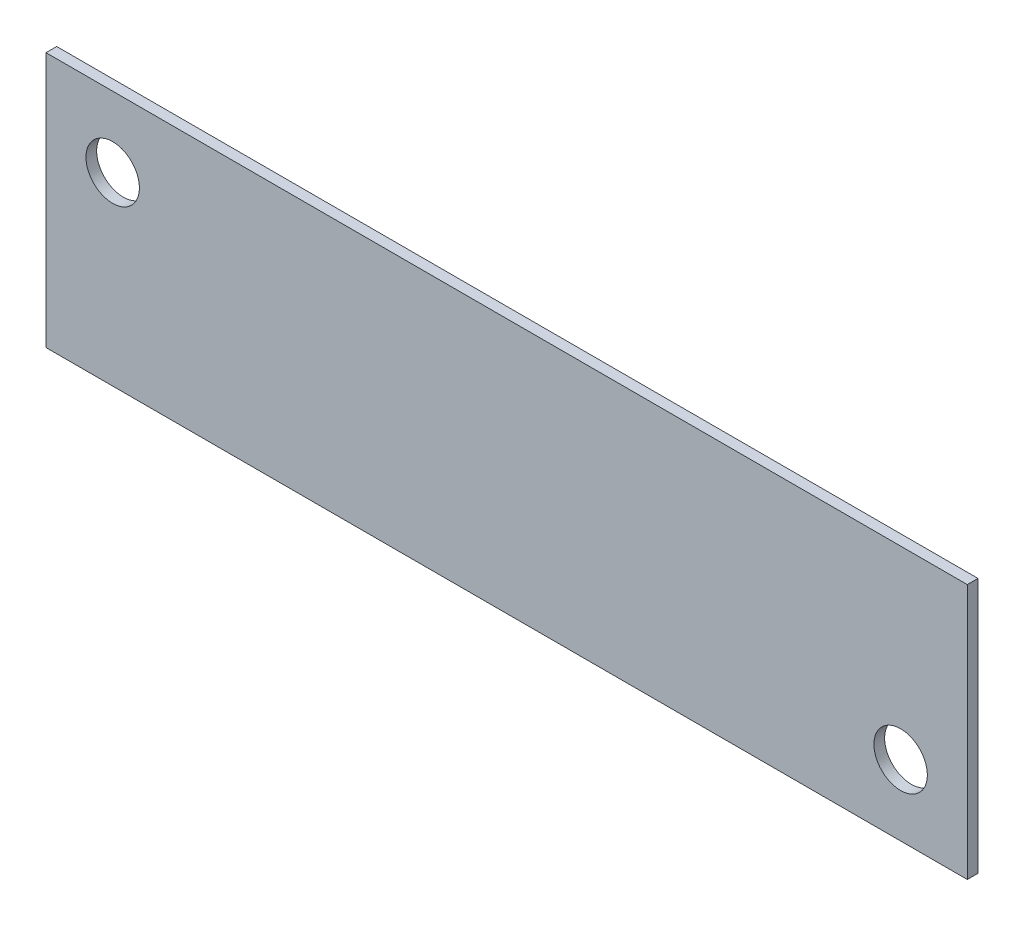
ISO-10303-21;
HEADER;
FILE_DESCRIPTION(('STEP AP214'),'2;1');
FILE_NAME('part.step','',(''),(''),'','','');
FILE_SCHEMA(('AUTOMOTIVE_DESIGN { 1 0 10303 214 1 1 1 1 }'));
ENDSEC;
DATA;
#1=APPLICATION_CONTEXT('core data for automotive mechanical design processes');
#2=APPLICATION_PROTOCOL_DEFINITION('international standard','automotive_design',2000,#1);
#3=PRODUCT_CONTEXT('',#1,'mechanical');
#4=PRODUCT('Part','Part','',(#3));
#5=PRODUCT_RELATED_PRODUCT_CATEGORY('part','',(#4));
#6=PRODUCT_DEFINITION_FORMATION('','',#4);
#7=PRODUCT_DEFINITION_CONTEXT('part definition',#1,'design');
#8=PRODUCT_DEFINITION('design','',#6,#7);
#9=PRODUCT_DEFINITION_SHAPE('','',#8);
#10=(LENGTH_UNIT() NAMED_UNIT(*) SI_UNIT(.MILLI.,.METRE.));
#11=(NAMED_UNIT(*) PLANE_ANGLE_UNIT() SI_UNIT($,.RADIAN.));
#12=(NAMED_UNIT(*) SI_UNIT($,.STERADIAN.) SOLID_ANGLE_UNIT());
#13=UNCERTAINTY_MEASURE_WITH_UNIT(LENGTH_MEASURE(1.E-05),#10,'distance_accuracy_value','');
#14=(GEOMETRIC_REPRESENTATION_CONTEXT(3) GLOBAL_UNCERTAINTY_ASSIGNED_CONTEXT((#13)) GLOBAL_UNIT_ASSIGNED_CONTEXT((#10,
#11,#12)) REPRESENTATION_CONTEXT('',''));
#15=CARTESIAN_POINT('',(0.,0.,0.));
#16=DIRECTION('',(0.,0.,1.));
#17=DIRECTION('',(1.,0.,0.));
#18=AXIS2_PLACEMENT_3D('',#15,#16,#17);
#19=CARTESIAN_POINT('',(-19.800000016,72.6750000000097,3.175));
#20=DIRECTION('',(1.,0.,0.));
#21=DIRECTION('',(0.,1.,0.));
#22=AXIS2_PLACEMENT_3D('',#19,#20,#21);
#23=PLANE('',#22);
#24=DIRECTION('',(0.,-1.,0.));
#25=VECTOR('',#24,1.);
#26=CARTESIAN_POINT('',(-19.800000016,72.6750000000097,0.));
#27=LINE('',#26,#25);
#28=CARTESIAN_POINT('',(-19.800000016,72.6750000000097,0.));
#29=VERTEX_POINT('',#28);
#30=CARTESIAN_POINT('',(-19.8000000159999,-3.17500000000004,0.));
#31=VERTEX_POINT('',#30);
#32=EDGE_CURVE('E97',#29,#31,#27,.T.);
#33=ORIENTED_EDGE('',*,*,#32,.T.);
#34=DIRECTION('',(0.,0.,-1.));
#35=VECTOR('',#34,1.);
#36=CARTESIAN_POINT('',(-19.8000000159999,-3.17500000000004,3.175));
#37=LINE('',#36,#35);
#38=CARTESIAN_POINT('',(-19.8000000159999,-3.17500000000004,3.175));
#39=VERTEX_POINT('',#38);
#40=EDGE_CURVE('E11',#39,#31,#37,.T.);
#41=ORIENTED_EDGE('',*,*,#40,.F.);
#42=DIRECTION('',(0.,-1.,0.));
#43=VECTOR('',#42,1.);
#44=CARTESIAN_POINT('',(-19.800000016,72.6750000000097,3.175));
#45=LINE('',#44,#43);
#46=CARTESIAN_POINT('',(-19.800000016,72.6750000000097,3.175));
#47=VERTEX_POINT('',#46);
#48=EDGE_CURVE('E85',#47,#39,#45,.T.);
#49=ORIENTED_EDGE('',*,*,#48,.F.);
#50=DIRECTION('',(0.,0.,-1.));
#51=VECTOR('',#50,1.);
#52=CARTESIAN_POINT('',(-19.800000016,72.6750000000097,3.175));
#53=LINE('',#52,#51);
#54=EDGE_CURVE('E93',#47,#29,#53,.T.);
#55=ORIENTED_EDGE('',*,*,#54,.T.);
#56=EDGE_LOOP('',(#33,#41,#49,#55));
#57=FACE_BOUND('',#56,.T.);
#58=ADVANCED_FACE('F34',(#57),#23,.F.);
#59=CARTESIAN_POINT('',(-19.8000000159999,-3.17500000000004,3.175));
#60=DIRECTION('',(0.,1.,0.));
#61=DIRECTION('',(-1.,0.,0.));
#62=AXIS2_PLACEMENT_3D('',#59,#60,#61);
#63=PLANE('',#62);
#64=DIRECTION('',(1.,0.,0.));
#65=VECTOR('',#64,1.);
#66=CARTESIAN_POINT('',(-19.8000000159999,-3.17500000000004,0.));
#67=LINE('',#66,#65);
#68=CARTESIAN_POINT('',(253.800000016,-3.17499999999999,0.));
#69=VERTEX_POINT('',#68);
#70=EDGE_CURVE('E89',#31,#69,#67,.T.);
#71=ORIENTED_EDGE('',*,*,#70,.T.);
#72=DIRECTION('',(0.,0.,-1.));
#73=VECTOR('',#72,1.);
#74=CARTESIAN_POINT('',(253.800000016,-3.17499999999999,3.175));
#75=LINE('',#74,#73);
#76=CARTESIAN_POINT('',(253.800000016,-3.17499999999999,3.175));
#77=VERTEX_POINT('',#76);
#78=EDGE_CURVE('E42',#77,#69,#75,.T.);
#79=ORIENTED_EDGE('',*,*,#78,.F.);
#80=DIRECTION('',(1.,0.,0.));
#81=VECTOR('',#80,1.);
#82=CARTESIAN_POINT('',(-19.8000000159999,-3.17500000000004,3.175));
#83=LINE('',#82,#81);
#84=EDGE_CURVE('E80',#39,#77,#83,.T.);
#85=ORIENTED_EDGE('',*,*,#84,.F.);
#86=ORIENTED_EDGE('',*,*,#40,.T.);
#87=EDGE_LOOP('',(#71,#79,#85,#86));
#88=FACE_BOUND('',#87,.T.);
#89=ADVANCED_FACE('F88',(#88),#63,.F.);
#90=CARTESIAN_POINT('',(253.800000016,72.6750000000098,3.175));
#91=DIRECTION('',(-1.,0.,0.));
#92=DIRECTION('',(0.,-1.,0.));
#93=AXIS2_PLACEMENT_3D('',#90,#91,#92);
#94=PLANE('',#93);
#95=DIRECTION('',(0.,1.,0.));
#96=VECTOR('',#95,1.);
#97=CARTESIAN_POINT('',(253.800000016,72.6750000000098,0.));
#98=LINE('',#97,#96);
#99=CARTESIAN_POINT('',(253.800000016,72.6750000000098,0.));
#100=VERTEX_POINT('',#99);
#101=EDGE_CURVE('E67',#69,#100,#98,.T.);
#102=ORIENTED_EDGE('',*,*,#101,.T.);
#103=DIRECTION('',(0.,0.,-1.));
#104=VECTOR('',#103,1.);
#105=CARTESIAN_POINT('',(253.800000016,72.6750000000098,3.175));
#106=LINE('',#105,#104);
#107=CARTESIAN_POINT('',(253.800000016,72.6750000000098,3.175));
#108=VERTEX_POINT('',#107);
#109=EDGE_CURVE('E90',#108,#100,#106,.T.);
#110=ORIENTED_EDGE('',*,*,#109,.F.);
#111=DIRECTION('',(0.,1.,0.));
#112=VECTOR('',#111,1.);
#113=CARTESIAN_POINT('',(253.800000016,72.6750000000098,3.175));
#114=LINE('',#113,#112);
#115=EDGE_CURVE('E83',#77,#108,#114,.T.);
#116=ORIENTED_EDGE('',*,*,#115,.F.);
#117=ORIENTED_EDGE('',*,*,#78,.T.);
#118=EDGE_LOOP('',(#102,#110,#116,#117));
#119=FACE_BOUND('',#118,.T.);
#120=ADVANCED_FACE('F91',(#119),#94,.F.);
#121=CARTESIAN_POINT('',(-19.800000016,72.6750000000097,3.175));
#122=DIRECTION('',(0.,-1.,0.));
#123=DIRECTION('',(1.,0.,0.));
#124=AXIS2_PLACEMENT_3D('',#121,#122,#123);
#125=PLANE('',#124);
#126=DIRECTION('',(-1.,0.,0.));
#127=VECTOR('',#126,1.);
#128=CARTESIAN_POINT('',(-19.800000016,72.6750000000097,0.));
#129=LINE('',#128,#127);
#130=EDGE_CURVE('E73',#100,#29,#129,.T.);
#131=ORIENTED_EDGE('',*,*,#130,.T.);
#132=ORIENTED_EDGE('',*,*,#54,.F.);
#133=DIRECTION('',(-1.,0.,0.));
#134=VECTOR('',#133,1.);
#135=CARTESIAN_POINT('',(-19.800000016,72.6750000000097,3.175));
#136=LINE('',#135,#134);
#137=EDGE_CURVE('E50',#108,#47,#136,.T.);
#138=ORIENTED_EDGE('',*,*,#137,.F.);
#139=ORIENTED_EDGE('',*,*,#109,.T.);
#140=EDGE_LOOP('',(#131,#132,#138,#139));
#141=FACE_BOUND('',#140,.T.);
#142=ADVANCED_FACE('F105',(#141),#125,.F.);
#143=CARTESIAN_POINT('',(0.,0.,3.175));
#144=DIRECTION('',(0.,0.,1.));
#145=DIRECTION('',(1.,0.,0.));
#146=AXIS2_PLACEMENT_3D('',#143,#144,#145);
#147=PLANE('',#146);
#148=CARTESIAN_POINT('',(0.,51.75,3.175));
#149=DIRECTION('',(0.,0.,1.));
#150=DIRECTION('',(1.,0.,0.));
#151=AXIS2_PLACEMENT_3D('',#148,#149,#150);
#152=CIRCLE('',#151,7.93750000000143);
#153=CARTESIAN_POINT('',(7.9375000000014,51.75,3.175));
#154=VERTEX_POINT('',#153);
#155=EDGE_CURVE('E114',#154,#154,#152,.T.);
#156=ORIENTED_EDGE('',*,*,#155,.F.);
#157=EDGE_LOOP('',(#156));
#158=FACE_BOUND('',#157,.T.);
#159=CARTESIAN_POINT('',(234.,17.75,3.175));
#160=DIRECTION('',(0.,0.,1.));
#161=DIRECTION('',(1.,0.,0.));
#162=AXIS2_PLACEMENT_3D('',#159,#160,#161);
#163=CIRCLE('',#162,7.93750000000141);
#164=CARTESIAN_POINT('',(241.937500000001,17.75,3.175));
#165=VERTEX_POINT('',#164);
#166=EDGE_CURVE('E115',#165,#165,#163,.T.);
#167=ORIENTED_EDGE('',*,*,#166,.F.);
#168=EDGE_LOOP('',(#167));
#169=FACE_BOUND('',#168,.T.);
#170=ORIENTED_EDGE('',*,*,#48,.T.);
#171=ORIENTED_EDGE('',*,*,#84,.T.);
#172=ORIENTED_EDGE('',*,*,#115,.T.);
#173=ORIENTED_EDGE('',*,*,#137,.T.);
#174=EDGE_LOOP('',(#170,#171,#172,#173));
#175=FACE_BOUND('',#174,.T.);
#176=ADVANCED_FACE('F81',(#158,#169,#175),#147,.T.);
#177=CARTESIAN_POINT('',(0.,0.,0.));
#178=DIRECTION('',(0.,0.,1.));
#179=DIRECTION('',(1.,0.,0.));
#180=AXIS2_PLACEMENT_3D('',#177,#178,#179);
#181=PLANE('',#180);
#182=CARTESIAN_POINT('',(0.,51.75,0.));
#183=DIRECTION('',(0.,0.,1.));
#184=DIRECTION('',(1.,0.,0.));
#185=AXIS2_PLACEMENT_3D('',#182,#183,#184);
#186=CIRCLE('',#185,7.93750000000143);
#187=CARTESIAN_POINT('',(7.9375000000014,51.75,0.));
#188=VERTEX_POINT('',#187);
#189=EDGE_CURVE('E100',#188,#188,#186,.F.);
#190=ORIENTED_EDGE('',*,*,#189,.F.);
#191=EDGE_LOOP('',(#190));
#192=FACE_BOUND('',#191,.T.);
#193=CARTESIAN_POINT('',(234.,17.75,0.));
#194=DIRECTION('',(0.,0.,1.));
#195=DIRECTION('',(1.,0.,0.));
#196=AXIS2_PLACEMENT_3D('',#193,#194,#195);
#197=CIRCLE('',#196,7.93750000000141);
#198=CARTESIAN_POINT('',(241.937500000001,17.75,0.));
#199=VERTEX_POINT('',#198);
#200=EDGE_CURVE('E111',#199,#199,#197,.F.);
#201=ORIENTED_EDGE('',*,*,#200,.F.);
#202=EDGE_LOOP('',(#201));
#203=FACE_BOUND('',#202,.T.);
#204=ORIENTED_EDGE('',*,*,#32,.F.);
#205=ORIENTED_EDGE('',*,*,#130,.F.);
#206=ORIENTED_EDGE('',*,*,#101,.F.);
#207=ORIENTED_EDGE('',*,*,#70,.F.);
#208=EDGE_LOOP('',(#204,#205,#206,#207));
#209=FACE_BOUND('',#208,.T.);
#210=ADVANCED_FACE('F108',(#192,#203,#209),#181,.F.);
#211=CARTESIAN_POINT('',(234.,17.75,-22.4506403026769));
#212=DIRECTION('',(0.,0.,1.));
#213=DIRECTION('',(1.,0.,0.));
#214=AXIS2_PLACEMENT_3D('',#211,#212,#213);
#215=CYLINDRICAL_SURFACE('',#214,7.93750000000141);
#216=ORIENTED_EDGE('',*,*,#200,.T.);
#217=EDGE_LOOP('',(#216));
#218=FACE_BOUND('',#217,.T.);
#219=ORIENTED_EDGE('',*,*,#166,.T.);
#220=EDGE_LOOP('',(#219));
#221=FACE_BOUND('',#220,.T.);
#222=ADVANCED_FACE('F130',(#218,#221),#215,.F.);
#223=CARTESIAN_POINT('',(0.,51.75,-22.4506403026769));
#224=DIRECTION('',(0.,0.,1.));
#225=DIRECTION('',(1.,0.,0.));
#226=AXIS2_PLACEMENT_3D('',#223,#224,#225);
#227=CYLINDRICAL_SURFACE('',#226,7.93750000000143);
#228=ORIENTED_EDGE('',*,*,#189,.T.);
#229=EDGE_LOOP('',(#228));
#230=FACE_BOUND('',#229,.T.);
#231=ORIENTED_EDGE('',*,*,#155,.T.);
#232=EDGE_LOOP('',(#231));
#233=FACE_BOUND('',#232,.T.);
#234=ADVANCED_FACE('F123',(#230,#233),#227,.F.);
#235=CLOSED_SHELL('',(#58,#89,#120,#142,#176,#210,#222,#234));
#236=MANIFOLD_SOLID_BREP('B2',#235);
#237=ADVANCED_BREP_SHAPE_REPRESENTATION('',(#18,#236),#14);
#238=SHAPE_DEFINITION_REPRESENTATION(#9,#237);
ENDSEC;
END-ISO-10303-21;
